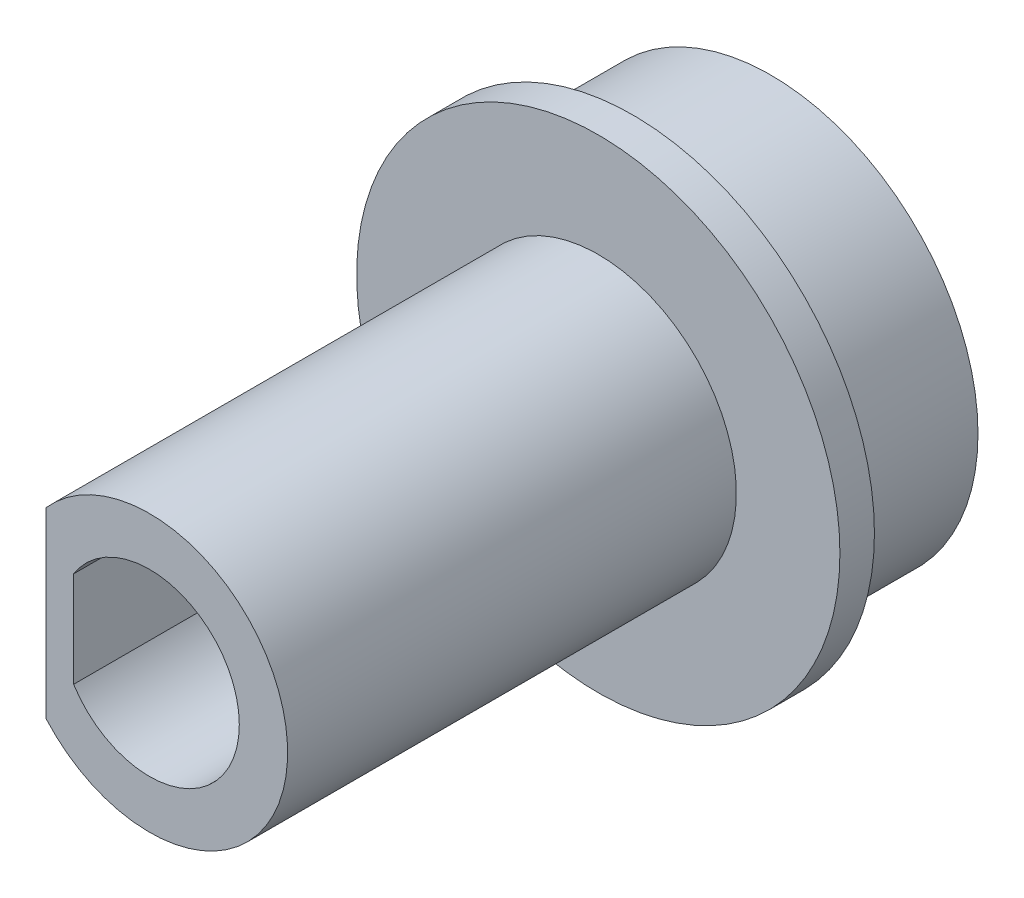
ISO-10303-21;
HEADER;
FILE_DESCRIPTION(('STEP AP214'),'2;1');
FILE_NAME('part.step','',(''),(''),'','','');
FILE_SCHEMA(('AUTOMOTIVE_DESIGN { 1 0 10303 214 1 1 1 1 }'));
ENDSEC;
DATA;
#1=APPLICATION_CONTEXT('core data for automotive mechanical design processes');
#2=APPLICATION_PROTOCOL_DEFINITION('international standard','automotive_design',2000,#1);
#3=PRODUCT_CONTEXT('',#1,'mechanical');
#4=PRODUCT('Part','Part','',(#3));
#5=PRODUCT_RELATED_PRODUCT_CATEGORY('part','',(#4));
#6=PRODUCT_DEFINITION_FORMATION('','',#4);
#7=PRODUCT_DEFINITION_CONTEXT('part definition',#1,'design');
#8=PRODUCT_DEFINITION('design','',#6,#7);
#9=PRODUCT_DEFINITION_SHAPE('','',#8);
#10=(LENGTH_UNIT() NAMED_UNIT(*) SI_UNIT(.MILLI.,.METRE.));
#11=(NAMED_UNIT(*) PLANE_ANGLE_UNIT() SI_UNIT($,.RADIAN.));
#12=(NAMED_UNIT(*) SI_UNIT($,.STERADIAN.) SOLID_ANGLE_UNIT());
#13=UNCERTAINTY_MEASURE_WITH_UNIT(LENGTH_MEASURE(1.E-05),#10,'distance_accuracy_value','');
#14=(GEOMETRIC_REPRESENTATION_CONTEXT(3) GLOBAL_UNCERTAINTY_ASSIGNED_CONTEXT((#13)) GLOBAL_UNIT_ASSIGNED_CONTEXT((#10,
#11,#12)) REPRESENTATION_CONTEXT('',''));
#15=CARTESIAN_POINT('',(0.,0.,0.));
#16=DIRECTION('',(0.,0.,1.));
#17=DIRECTION('',(1.,0.,0.));
#18=AXIS2_PLACEMENT_3D('',#15,#16,#17);
#19=CARTESIAN_POINT('',(0.,0.,0.));
#20=DIRECTION('',(0.,0.,1.));
#21=DIRECTION('',(1.,0.,0.));
#22=AXIS2_PLACEMENT_3D('',#19,#20,#21);
#23=PLANE('',#22);
#24=CARTESIAN_POINT('',(0.,0.,0.));
#25=DIRECTION('',(0.,0.,1.));
#26=DIRECTION('',(1.,0.,0.));
#27=AXIS2_PLACEMENT_3D('',#24,#25,#26);
#28=CIRCLE('',#27,6.);
#29=CARTESIAN_POINT('',(6.,0.,0.));
#30=VERTEX_POINT('',#29);
#31=EDGE_CURVE('E49',#30,#30,#28,.T.);
#32=ORIENTED_EDGE('',*,*,#31,.F.);
#33=EDGE_LOOP('',(#32));
#34=FACE_BOUND('',#33,.T.);
#35=CARTESIAN_POINT('',(0.,0.,0.));
#36=DIRECTION('',(0.,0.,-1.));
#37=DIRECTION('',(-1.,0.,0.));
#38=AXIS2_PLACEMENT_3D('',#35,#36,#37);
#39=CIRCLE('',#38,2.6);
#40=CARTESIAN_POINT('',(-2.2,-1.3856406460551,0.));
#41=VERTEX_POINT('',#40);
#42=CARTESIAN_POINT('',(-2.2,1.3856406460551,0.));
#43=VERTEX_POINT('',#42);
#44=EDGE_CURVE('E56',#41,#43,#39,.F.);
#45=ORIENTED_EDGE('',*,*,#44,.T.);
#46=DIRECTION('',(0.,-1.,0.));
#47=VECTOR('',#46,1.);
#48=CARTESIAN_POINT('',(-2.2,0.,0.));
#49=LINE('',#48,#47);
#50=EDGE_CURVE('E92',#43,#41,#49,.T.);
#51=ORIENTED_EDGE('',*,*,#50,.T.);
#52=EDGE_LOOP('',(#45,#51));
#53=FACE_BOUND('',#52,.T.);
#54=ADVANCED_FACE('F41',(#34,#53),#23,.F.);
#55=CARTESIAN_POINT('',(0.,0.,18.));
#56=DIRECTION('',(0.,0.,1.));
#57=DIRECTION('',(1.,0.,0.));
#58=AXIS2_PLACEMENT_3D('',#55,#56,#57);
#59=PLANE('',#58);
#60=DIRECTION('',(0.,-1.,0.));
#61=VECTOR('',#60,1.);
#62=CARTESIAN_POINT('',(-3.,0.,18.));
#63=LINE('',#62,#61);
#64=CARTESIAN_POINT('',(-3.,2.64575131106459,18.));
#65=VERTEX_POINT('',#64);
#66=CARTESIAN_POINT('',(-3.,-2.64575131106459,18.));
#67=VERTEX_POINT('',#66);
#68=EDGE_CURVE('E99',#65,#67,#63,.T.);
#69=ORIENTED_EDGE('',*,*,#68,.T.);
#70=CARTESIAN_POINT('',(0.,0.,18.));
#71=DIRECTION('',(0.,0.,1.));
#72=DIRECTION('',(1.,0.,0.));
#73=AXIS2_PLACEMENT_3D('',#70,#71,#72);
#74=CIRCLE('',#73,4.);
#75=EDGE_CURVE('E102',#67,#65,#74,.T.);
#76=ORIENTED_EDGE('',*,*,#75,.T.);
#77=EDGE_LOOP('',(#69,#76));
#78=FACE_BOUND('',#77,.T.);
#79=DIRECTION('',(0.,-1.,0.));
#80=VECTOR('',#79,1.);
#81=CARTESIAN_POINT('',(-2.2,0.,18.));
#82=LINE('',#81,#80);
#83=CARTESIAN_POINT('',(-2.2,1.3856406460551,18.));
#84=VERTEX_POINT('',#83);
#85=CARTESIAN_POINT('',(-2.2,-1.3856406460551,18.));
#86=VERTEX_POINT('',#85);
#87=EDGE_CURVE('E81',#84,#86,#82,.T.);
#88=ORIENTED_EDGE('',*,*,#87,.F.);
#89=CARTESIAN_POINT('',(0.,0.,18.));
#90=DIRECTION('',(0.,0.,-1.));
#91=DIRECTION('',(-1.,0.,0.));
#92=AXIS2_PLACEMENT_3D('',#89,#90,#91);
#93=CIRCLE('',#92,2.6);
#94=EDGE_CURVE('E87',#86,#84,#93,.F.);
#95=ORIENTED_EDGE('',*,*,#94,.F.);
#96=EDGE_LOOP('',(#88,#95));
#97=FACE_BOUND('',#96,.T.);
#98=ADVANCED_FACE('F91',(#78,#97),#59,.T.);
#99=CARTESIAN_POINT('',(0.,0.,5.));
#100=DIRECTION('',(0.,0.,-1.));
#101=DIRECTION('',(-1.,0.,0.));
#102=AXIS2_PLACEMENT_3D('',#99,#100,#101);
#103=CYLINDRICAL_SURFACE('',#102,6.);
#104=ORIENTED_EDGE('',*,*,#31,.T.);
#105=EDGE_LOOP('',(#104));
#106=FACE_BOUND('',#105,.T.);
#107=CARTESIAN_POINT('',(0.,0.,4.));
#108=DIRECTION('',(0.,0.,1.));
#109=DIRECTION('',(1.,0.,0.));
#110=AXIS2_PLACEMENT_3D('',#107,#108,#109);
#111=CIRCLE('',#110,6.);
#112=CARTESIAN_POINT('',(6.,0.,4.));
#113=VERTEX_POINT('',#112);
#114=EDGE_CURVE('E11',#113,#113,#111,.T.);
#115=ORIENTED_EDGE('',*,*,#114,.F.);
#116=EDGE_LOOP('',(#115));
#117=FACE_BOUND('',#116,.T.);
#118=ADVANCED_FACE('F43',(#106,#117),#103,.T.);
#119=CARTESIAN_POINT('',(0.,0.,4.));
#120=DIRECTION('',(0.,0.,1.));
#121=DIRECTION('',(1.,0.,0.));
#122=AXIS2_PLACEMENT_3D('',#119,#120,#121);
#123=CYLINDRICAL_SURFACE('',#122,7.);
#124=CARTESIAN_POINT('',(0.,0.,4.));
#125=DIRECTION('',(0.,0.,1.));
#126=DIRECTION('',(1.,0.,0.));
#127=AXIS2_PLACEMENT_3D('',#124,#125,#126);
#128=CIRCLE('',#127,7.);
#129=CARTESIAN_POINT('',(7.,0.,4.));
#130=VERTEX_POINT('',#129);
#131=EDGE_CURVE('E116',#130,#130,#128,.T.);
#132=ORIENTED_EDGE('',*,*,#131,.T.);
#133=EDGE_LOOP('',(#132));
#134=FACE_BOUND('',#133,.T.);
#135=CARTESIAN_POINT('',(0.,0.,5.));
#136=DIRECTION('',(0.,0.,1.));
#137=DIRECTION('',(1.,0.,0.));
#138=AXIS2_PLACEMENT_3D('',#135,#136,#137);
#139=CIRCLE('',#138,7.);
#140=CARTESIAN_POINT('',(7.,0.,5.));
#141=VERTEX_POINT('',#140);
#142=EDGE_CURVE('E115',#141,#141,#139,.T.);
#143=ORIENTED_EDGE('',*,*,#142,.F.);
#144=EDGE_LOOP('',(#143));
#145=FACE_BOUND('',#144,.T.);
#146=ADVANCED_FACE('F139',(#134,#145),#123,.T.);
#147=CARTESIAN_POINT('',(0.,0.,4.));
#148=DIRECTION('',(0.,0.,1.));
#149=DIRECTION('',(1.,0.,0.));
#150=AXIS2_PLACEMENT_3D('',#147,#148,#149);
#151=PLANE('',#150);
#152=ORIENTED_EDGE('',*,*,#114,.T.);
#153=EDGE_LOOP('',(#152));
#154=FACE_BOUND('',#153,.T.);
#155=ORIENTED_EDGE('',*,*,#131,.F.);
#156=EDGE_LOOP('',(#155));
#157=FACE_BOUND('',#156,.T.);
#158=ADVANCED_FACE('F137',(#154,#157),#151,.F.);
#159=CARTESIAN_POINT('',(0.,0.,5.));
#160=DIRECTION('',(0.,0.,1.));
#161=DIRECTION('',(1.,0.,0.));
#162=AXIS2_PLACEMENT_3D('',#159,#160,#161);
#163=PLANE('',#162);
#164=DIRECTION('',(0.,-1.,0.));
#165=VECTOR('',#164,1.);
#166=CARTESIAN_POINT('',(-3.,0.,5.));
#167=LINE('',#166,#165);
#168=CARTESIAN_POINT('',(-3.,2.64575131106459,5.));
#169=VERTEX_POINT('',#168);
#170=CARTESIAN_POINT('',(-3.,-2.64575131106459,5.));
#171=VERTEX_POINT('',#170);
#172=EDGE_CURVE('E97',#169,#171,#167,.T.);
#173=ORIENTED_EDGE('',*,*,#172,.F.);
#174=CARTESIAN_POINT('',(0.,0.,5.));
#175=DIRECTION('',(0.,0.,1.));
#176=DIRECTION('',(1.,0.,0.));
#177=AXIS2_PLACEMENT_3D('',#174,#175,#176);
#178=CIRCLE('',#177,4.);
#179=EDGE_CURVE('E103',#171,#169,#178,.T.);
#180=ORIENTED_EDGE('',*,*,#179,.F.);
#181=EDGE_LOOP('',(#173,#180));
#182=FACE_BOUND('',#181,.T.);
#183=ORIENTED_EDGE('',*,*,#142,.T.);
#184=EDGE_LOOP('',(#183));
#185=FACE_BOUND('',#184,.T.);
#186=ADVANCED_FACE('F133',(#182,#185),#163,.T.);
#187=CARTESIAN_POINT('',(-3.,0.,18.));
#188=DIRECTION('',(1.,0.,0.));
#189=DIRECTION('',(0.,0.,-1.));
#190=AXIS2_PLACEMENT_3D('',#187,#188,#189);
#191=PLANE('',#190);
#192=ORIENTED_EDGE('',*,*,#172,.T.);
#193=DIRECTION('',(0.,0.,-1.));
#194=VECTOR('',#193,1.);
#195=CARTESIAN_POINT('',(-3.,-2.64575131106459,18.));
#196=LINE('',#195,#194);
#197=EDGE_CURVE('E112',#67,#171,#196,.T.);
#198=ORIENTED_EDGE('',*,*,#197,.F.);
#199=ORIENTED_EDGE('',*,*,#68,.F.);
#200=DIRECTION('',(0.,0.,-1.));
#201=VECTOR('',#200,1.);
#202=CARTESIAN_POINT('',(-3.,2.64575131106459,18.));
#203=LINE('',#202,#201);
#204=EDGE_CURVE('E105',#65,#169,#203,.T.);
#205=ORIENTED_EDGE('',*,*,#204,.T.);
#206=EDGE_LOOP('',(#192,#198,#199,#205));
#207=FACE_BOUND('',#206,.T.);
#208=ADVANCED_FACE('F136',(#207),#191,.F.);
#209=CARTESIAN_POINT('',(0.,0.,18.));
#210=DIRECTION('',(0.,0.,-1.));
#211=DIRECTION('',(-1.,0.,0.));
#212=AXIS2_PLACEMENT_3D('',#209,#210,#211);
#213=CYLINDRICAL_SURFACE('',#212,4.);
#214=ORIENTED_EDGE('',*,*,#179,.T.);
#215=ORIENTED_EDGE('',*,*,#204,.F.);
#216=ORIENTED_EDGE('',*,*,#75,.F.);
#217=ORIENTED_EDGE('',*,*,#197,.T.);
#218=EDGE_LOOP('',(#214,#215,#216,#217));
#219=FACE_BOUND('',#218,.T.);
#220=ADVANCED_FACE('F148',(#219),#213,.T.);
#221=CARTESIAN_POINT('',(0.,0.,18.));
#222=DIRECTION('',(0.,0.,-1.));
#223=DIRECTION('',(-1.,0.,0.));
#224=AXIS2_PLACEMENT_3D('',#221,#222,#223);
#225=CYLINDRICAL_SURFACE('',#224,2.6);
#226=ORIENTED_EDGE('',*,*,#44,.F.);
#227=DIRECTION('',(0.,0.,-1.));
#228=VECTOR('',#227,1.);
#229=CARTESIAN_POINT('',(-2.2,-1.3856406460551,18.));
#230=LINE('',#229,#228);
#231=EDGE_CURVE('E83',#86,#41,#230,.T.);
#232=ORIENTED_EDGE('',*,*,#231,.F.);
#233=ORIENTED_EDGE('',*,*,#94,.T.);
#234=DIRECTION('',(0.,0.,-1.));
#235=VECTOR('',#234,1.);
#236=CARTESIAN_POINT('',(-2.2,1.3856406460551,18.));
#237=LINE('',#236,#235);
#238=EDGE_CURVE('E63',#84,#43,#237,.T.);
#239=ORIENTED_EDGE('',*,*,#238,.T.);
#240=EDGE_LOOP('',(#226,#232,#233,#239));
#241=FACE_BOUND('',#240,.T.);
#242=ADVANCED_FACE('F89',(#241),#225,.F.);
#243=CARTESIAN_POINT('',(-2.2,0.,18.));
#244=DIRECTION('',(1.,0.,0.));
#245=DIRECTION('',(0.,0.,-1.));
#246=AXIS2_PLACEMENT_3D('',#243,#244,#245);
#247=PLANE('',#246);
#248=ORIENTED_EDGE('',*,*,#50,.F.);
#249=ORIENTED_EDGE('',*,*,#238,.F.);
#250=ORIENTED_EDGE('',*,*,#87,.T.);
#251=ORIENTED_EDGE('',*,*,#231,.T.);
#252=EDGE_LOOP('',(#248,#249,#250,#251));
#253=FACE_BOUND('',#252,.T.);
#254=ADVANCED_FACE('F82',(#253),#247,.T.);
#255=CLOSED_SHELL('',(#54,#98,#118,#146,#158,#186,#208,#220,#242,#254));
#256=MANIFOLD_SOLID_BREP('B2',#255);
#257=ADVANCED_BREP_SHAPE_REPRESENTATION('',(#18,#256),#14);
#258=SHAPE_DEFINITION_REPRESENTATION(#9,#257);
ENDSEC;
END-ISO-10303-21;
